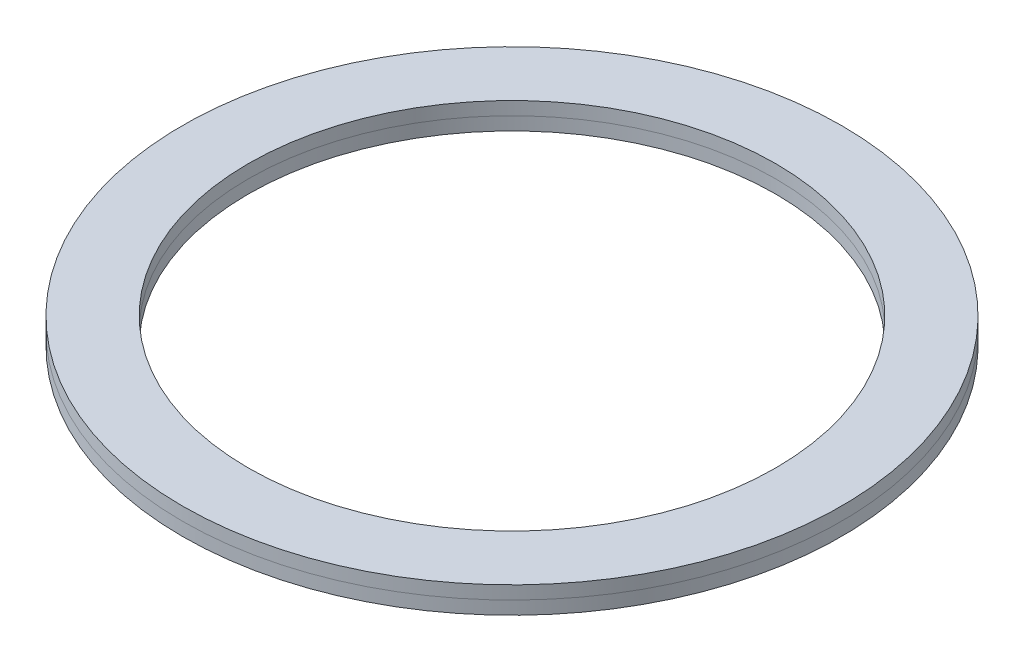
ISO-10303-21;
HEADER;
FILE_DESCRIPTION(('STEP AP214'),'2;1');
FILE_NAME('part.step','',(''),(''),'','','');
FILE_SCHEMA(('AUTOMOTIVE_DESIGN { 1 0 10303 214 1 1 1 1 }'));
ENDSEC;
DATA;
#1=APPLICATION_CONTEXT('core data for automotive mechanical design processes');
#2=APPLICATION_PROTOCOL_DEFINITION('international standard','automotive_design',2000,#1);
#3=PRODUCT_CONTEXT('',#1,'mechanical');
#4=PRODUCT('Part','Part','',(#3));
#5=PRODUCT_RELATED_PRODUCT_CATEGORY('part','',(#4));
#6=PRODUCT_DEFINITION_FORMATION('','',#4);
#7=PRODUCT_DEFINITION_CONTEXT('part definition',#1,'design');
#8=PRODUCT_DEFINITION('design','',#6,#7);
#9=PRODUCT_DEFINITION_SHAPE('','',#8);
#10=(LENGTH_UNIT() NAMED_UNIT(*) SI_UNIT(.MILLI.,.METRE.));
#11=(NAMED_UNIT(*) PLANE_ANGLE_UNIT() SI_UNIT($,.RADIAN.));
#12=(NAMED_UNIT(*) SI_UNIT($,.STERADIAN.) SOLID_ANGLE_UNIT());
#13=UNCERTAINTY_MEASURE_WITH_UNIT(LENGTH_MEASURE(1.E-05),#10,'distance_accuracy_value','');
#14=(GEOMETRIC_REPRESENTATION_CONTEXT(3) GLOBAL_UNCERTAINTY_ASSIGNED_CONTEXT((#13)) GLOBAL_UNIT_ASSIGNED_CONTEXT((#10,
#11,#12)) REPRESENTATION_CONTEXT('',''));
#15=CARTESIAN_POINT('',(0.,0.,0.));
#16=DIRECTION('',(0.,0.,1.));
#17=DIRECTION('',(1.,0.,0.));
#18=AXIS2_PLACEMENT_3D('',#15,#16,#17);
#19=CARTESIAN_POINT('',(0.,1.,0.));
#20=DIRECTION('',(0.,1.,0.));
#21=DIRECTION('',(0.,0.,1.));
#22=AXIS2_PLACEMENT_3D('',#19,#20,#21);
#23=PLANE('',#22);
#24=CARTESIAN_POINT('',(0.,1.,0.));
#25=DIRECTION('',(0.,1.,0.));
#26=DIRECTION('',(0.,0.,1.));
#27=AXIS2_PLACEMENT_3D('',#24,#25,#26);
#28=CIRCLE('',#27,25.);
#29=CARTESIAN_POINT('',(0.,1.,25.));
#30=VERTEX_POINT('',#29);
#31=EDGE_CURVE('E58',#30,#30,#28,.T.);
#32=ORIENTED_EDGE('',*,*,#31,.T.);
#33=EDGE_LOOP('',(#32));
#34=FACE_BOUND('',#33,.T.);
#35=CARTESIAN_POINT('',(0.,1.,0.));
#36=DIRECTION('',(0.,1.,0.));
#37=DIRECTION('',(0.,0.,1.));
#38=AXIS2_PLACEMENT_3D('',#35,#36,#37);
#39=CIRCLE('',#38,20.);
#40=CARTESIAN_POINT('',(0.,1.,20.));
#41=VERTEX_POINT('',#40);
#42=EDGE_CURVE('E49',#41,#41,#39,.F.);
#43=ORIENTED_EDGE('',*,*,#42,.T.);
#44=EDGE_LOOP('',(#43));
#45=FACE_BOUND('',#44,.T.);
#46=ADVANCED_FACE('F45',(#34,#45),#23,.T.);
#47=CARTESIAN_POINT('',(0.,0.,0.));
#48=DIRECTION('',(0.,-1.,0.));
#49=DIRECTION('',(0.,0.,-1.));
#50=AXIS2_PLACEMENT_3D('',#47,#48,#49);
#51=CYLINDRICAL_SURFACE('',#50,25.);
#52=CARTESIAN_POINT('',(0.,0.,0.));
#53=DIRECTION('',(0.,-1.,0.));
#54=DIRECTION('',(0.,0.,-1.));
#55=AXIS2_PLACEMENT_3D('',#52,#53,#54);
#56=CIRCLE('',#55,25.);
#57=CARTESIAN_POINT('',(0.,0.,-25.));
#58=VERTEX_POINT('',#57);
#59=EDGE_CURVE('E12',#58,#58,#56,.T.);
#60=ORIENTED_EDGE('',*,*,#59,.F.);
#61=EDGE_LOOP('',(#60));
#62=FACE_BOUND('',#61,.T.);
#63=ORIENTED_EDGE('',*,*,#31,.F.);
#64=EDGE_LOOP('',(#63));
#65=FACE_BOUND('',#64,.T.);
#66=ADVANCED_FACE('F47',(#62,#65),#51,.T.);
#67=CARTESIAN_POINT('',(0.,0.,0.));
#68=DIRECTION('',(0.,-1.,0.));
#69=DIRECTION('',(0.,0.,-1.));
#70=AXIS2_PLACEMENT_3D('',#67,#68,#69);
#71=CYLINDRICAL_SURFACE('',#70,20.);
#72=CARTESIAN_POINT('',(0.,0.,0.));
#73=DIRECTION('',(0.,-1.,0.));
#74=DIRECTION('',(0.,0.,-1.));
#75=AXIS2_PLACEMENT_3D('',#72,#73,#74);
#76=CIRCLE('',#75,20.);
#77=CARTESIAN_POINT('',(0.,0.,-20.));
#78=VERTEX_POINT('',#77);
#79=EDGE_CURVE('E53',#78,#78,#76,.T.);
#80=ORIENTED_EDGE('',*,*,#79,.T.);
#81=EDGE_LOOP('',(#80));
#82=FACE_BOUND('',#81,.T.);
#83=ORIENTED_EDGE('',*,*,#42,.F.);
#84=EDGE_LOOP('',(#83));
#85=FACE_BOUND('',#84,.T.);
#86=ADVANCED_FACE('F67',(#82,#85),#71,.F.);
#87=CARTESIAN_POINT('',(-25.,0.,0.));
#88=DIRECTION('',(0.,1.,0.));
#89=DIRECTION('',(0.,0.,1.));
#90=AXIS2_PLACEMENT_3D('',#87,#88,#89);
#91=PLANE('',#90);
#92=ORIENTED_EDGE('',*,*,#79,.F.);
#93=EDGE_LOOP('',(#92));
#94=FACE_BOUND('',#93,.T.);
#95=ORIENTED_EDGE('',*,*,#59,.T.);
#96=EDGE_LOOP('',(#95));
#97=FACE_BOUND('',#96,.T.);
#98=ADVANCED_FACE('F69',(#94,#97),#91,.F.);
#99=CLOSED_SHELL('',(#46,#66,#86,#98));
#100=MANIFOLD_SOLID_BREP('B2',#99);
#101=CARTESIAN_POINT('',(0.,1.,0.));
#102=DIRECTION('',(0.,1.,0.));
#103=DIRECTION('',(0.,0.,1.));
#104=AXIS2_PLACEMENT_3D('',#101,#102,#103);
#105=PLANE('',#104);
#106=CARTESIAN_POINT('',(0.,1.,0.));
#107=DIRECTION('',(0.,1.,0.));
#108=DIRECTION('',(0.,0.,1.));
#109=AXIS2_PLACEMENT_3D('',#106,#107,#108);
#110=CIRCLE('',#109,20.);
#111=CARTESIAN_POINT('',(0.,1.,20.));
#112=VERTEX_POINT('',#111);
#113=EDGE_CURVE('E112',#112,#112,#110,.F.);
#114=ORIENTED_EDGE('',*,*,#113,.F.);
#115=EDGE_LOOP('',(#114));
#116=FACE_BOUND('',#115,.T.);
#117=CARTESIAN_POINT('',(0.,1.,0.));
#118=DIRECTION('',(0.,1.,0.));
#119=DIRECTION('',(0.,0.,1.));
#120=AXIS2_PLACEMENT_3D('',#117,#118,#119);
#121=CIRCLE('',#120,25.);
#122=CARTESIAN_POINT('',(0.,1.,25.));
#123=VERTEX_POINT('',#122);
#124=EDGE_CURVE('E44',#123,#123,#121,.T.);
#125=ORIENTED_EDGE('',*,*,#124,.F.);
#126=EDGE_LOOP('',(#125));
#127=FACE_BOUND('',#126,.T.);
#128=ADVANCED_FACE('F106',(#116,#127),#105,.F.);
#129=CARTESIAN_POINT('',(-25.,2.,0.));
#130=DIRECTION('',(0.,-1.,0.));
#131=DIRECTION('',(0.,0.,-1.));
#132=AXIS2_PLACEMENT_3D('',#129,#130,#131);
#133=PLANE('',#132);
#134=CARTESIAN_POINT('',(0.,2.,0.));
#135=DIRECTION('',(0.,-1.,0.));
#136=DIRECTION('',(0.,0.,-1.));
#137=AXIS2_PLACEMENT_3D('',#134,#135,#136);
#138=CIRCLE('',#137,25.);
#139=CARTESIAN_POINT('',(0.,2.,-25.));
#140=VERTEX_POINT('',#139);
#141=EDGE_CURVE('E116',#140,#140,#138,.T.);
#142=ORIENTED_EDGE('',*,*,#141,.F.);
#143=EDGE_LOOP('',(#142));
#144=FACE_BOUND('',#143,.T.);
#145=CARTESIAN_POINT('',(0.,2.,0.));
#146=DIRECTION('',(0.,-1.,0.));
#147=DIRECTION('',(0.,0.,-1.));
#148=AXIS2_PLACEMENT_3D('',#145,#146,#147);
#149=CIRCLE('',#148,20.);
#150=CARTESIAN_POINT('',(0.,2.,-20.));
#151=VERTEX_POINT('',#150);
#152=EDGE_CURVE('E120',#151,#151,#149,.T.);
#153=ORIENTED_EDGE('',*,*,#152,.T.);
#154=EDGE_LOOP('',(#153));
#155=FACE_BOUND('',#154,.T.);
#156=ADVANCED_FACE('F126',(#144,#155),#133,.F.);
#157=CARTESIAN_POINT('',(0.,0.,0.));
#158=DIRECTION('',(0.,-1.,0.));
#159=DIRECTION('',(0.,0.,-1.));
#160=AXIS2_PLACEMENT_3D('',#157,#158,#159);
#161=CYLINDRICAL_SURFACE('',#160,20.);
#162=ORIENTED_EDGE('',*,*,#113,.T.);
#163=EDGE_LOOP('',(#162));
#164=FACE_BOUND('',#163,.T.);
#165=ORIENTED_EDGE('',*,*,#152,.F.);
#166=EDGE_LOOP('',(#165));
#167=FACE_BOUND('',#166,.T.);
#168=ADVANCED_FACE('F128',(#164,#167),#161,.F.);
#169=CARTESIAN_POINT('',(0.,0.,0.));
#170=DIRECTION('',(0.,-1.,0.));
#171=DIRECTION('',(0.,0.,-1.));
#172=AXIS2_PLACEMENT_3D('',#169,#170,#171);
#173=CYLINDRICAL_SURFACE('',#172,25.);
#174=ORIENTED_EDGE('',*,*,#124,.T.);
#175=EDGE_LOOP('',(#174));
#176=FACE_BOUND('',#175,.T.);
#177=ORIENTED_EDGE('',*,*,#141,.T.);
#178=EDGE_LOOP('',(#177));
#179=FACE_BOUND('',#178,.T.);
#180=ADVANCED_FACE('F130',(#176,#179),#173,.T.);
#181=CLOSED_SHELL('',(#128,#156,#168,#180));
#182=MANIFOLD_SOLID_BREP('B7',#181);
#183=ADVANCED_BREP_SHAPE_REPRESENTATION('',(#18,#100,#182),#14);
#184=SHAPE_DEFINITION_REPRESENTATION(#9,#183);
ENDSEC;
END-ISO-10303-21;
